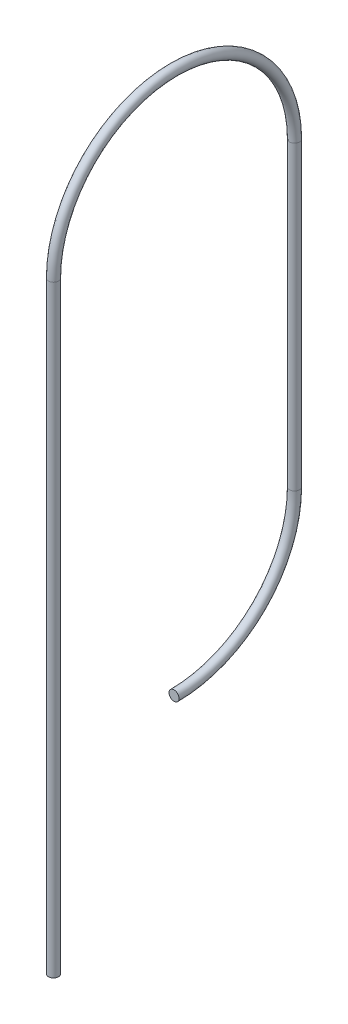
ISO-10303-21;
HEADER;
FILE_DESCRIPTION(('STEP AP214'),'2;1');
FILE_NAME('part.step','',(''),(''),'','','');
FILE_SCHEMA(('AUTOMOTIVE_DESIGN { 1 0 10303 214 1 1 1 1 }'));
ENDSEC;
DATA;
#1=APPLICATION_CONTEXT('core data for automotive mechanical design processes');
#2=APPLICATION_PROTOCOL_DEFINITION('international standard','automotive_design',2000,#1);
#3=PRODUCT_CONTEXT('',#1,'mechanical');
#4=PRODUCT('Part','Part','',(#3));
#5=PRODUCT_RELATED_PRODUCT_CATEGORY('part','',(#4));
#6=PRODUCT_DEFINITION_FORMATION('','',#4);
#7=PRODUCT_DEFINITION_CONTEXT('part definition',#1,'design');
#8=PRODUCT_DEFINITION('design','',#6,#7);
#9=PRODUCT_DEFINITION_SHAPE('','',#8);
#10=(LENGTH_UNIT() NAMED_UNIT(*) SI_UNIT(.MILLI.,.METRE.));
#11=(NAMED_UNIT(*) PLANE_ANGLE_UNIT() SI_UNIT($,.RADIAN.));
#12=(NAMED_UNIT(*) SI_UNIT($,.STERADIAN.) SOLID_ANGLE_UNIT());
#13=UNCERTAINTY_MEASURE_WITH_UNIT(LENGTH_MEASURE(1.E-05),#10,'distance_accuracy_value','');
#14=(GEOMETRIC_REPRESENTATION_CONTEXT(3) GLOBAL_UNCERTAINTY_ASSIGNED_CONTEXT((#13)) GLOBAL_UNIT_ASSIGNED_CONTEXT((#10,
#11,#12)) REPRESENTATION_CONTEXT('',''));
#15=CARTESIAN_POINT('',(0.,0.,0.));
#16=DIRECTION('',(0.,0.,1.));
#17=DIRECTION('',(1.,0.,0.));
#18=AXIS2_PLACEMENT_3D('',#15,#16,#17);
#19=CARTESIAN_POINT('',(0.,0.,0.));
#20=DIRECTION('',(0.,1.,0.));
#21=DIRECTION('',(0.,0.,1.));
#22=AXIS2_PLACEMENT_3D('',#19,#20,#21);
#23=PLANE('',#22);
#24=CARTESIAN_POINT('',(0.,0.,0.));
#25=DIRECTION('',(0.,1.,0.));
#26=DIRECTION('',(0.,0.,1.));
#27=AXIS2_PLACEMENT_3D('',#24,#25,#26);
#28=CIRCLE('',#27,1.25);
#29=CARTESIAN_POINT('',(0.,0.,1.25));
#30=VERTEX_POINT('',#29);
#31=EDGE_CURVE('E53',#30,#30,#28,.T.);
#32=ORIENTED_EDGE('',*,*,#31,.F.);
#33=EDGE_LOOP('',(#32));
#34=FACE_BOUND('',#33,.T.);
#35=ADVANCED_FACE('F34',(#34),#23,.F.);
#36=CARTESIAN_POINT('',(0.,45.0000006982674,-30.0064727151885));
#37=DIRECTION('',(0.,-0.000215757172950433,0.999999976724421));
#38=DIRECTION('',(0.,-0.999999976724421,-0.000215757172950433));
#39=AXIS2_PLACEMENT_3D('',#36,#37,#38);
#40=PLANE('',#39);
#41=CARTESIAN_POINT('',(0.,45.0000006982674,-30.0064727151885));
#42=DIRECTION('',(0.,-0.000215757172950433,0.999999976724421));
#43=DIRECTION('',(0.,-0.999999976724421,-0.000215757172950433));
#44=AXIS2_PLACEMENT_3D('',#41,#42,#43);
#45=CIRCLE('',#44,1.25);
#46=CARTESIAN_POINT('',(0.,43.7500007273619,-30.0067424116547));
#47=VERTEX_POINT('',#46);
#48=EDGE_CURVE('E10',#47,#47,#45,.T.);
#49=ORIENTED_EDGE('',*,*,#48,.T.);
#50=EDGE_LOOP('',(#49));
#51=FACE_BOUND('',#50,.T.);
#52=ADVANCED_FACE('F60',(#51),#40,.T.);
#53=CARTESIAN_POINT('',(0.,0.,0.));
#54=DIRECTION('',(0.,1.,0.));
#55=DIRECTION('',(0.,0.,1.));
#56=AXIS2_PLACEMENT_3D('',#53,#54,#55);
#57=CYLINDRICAL_SURFACE('',#56,1.25);
#58=CARTESIAN_POINT('',(0.,150.,0.));
#59=DIRECTION('',(0.,1.,0.));
#60=DIRECTION('',(0.,0.,1.));
#61=AXIS2_PLACEMENT_3D('',#58,#59,#60);
#62=CIRCLE('',#61,1.25);
#63=CARTESIAN_POINT('',(0.,150.,1.25));
#64=VERTEX_POINT('',#63);
#65=EDGE_CURVE('E48',#64,#64,#62,.T.);
#66=ORIENTED_EDGE('',*,*,#65,.F.);
#67=EDGE_LOOP('',(#66));
#68=FACE_BOUND('',#67,.T.);
#69=ORIENTED_EDGE('',*,*,#31,.T.);
#70=EDGE_LOOP('',(#69));
#71=FACE_BOUND('',#70,.T.);
#72=ADVANCED_FACE('F57',(#68,#71),#57,.T.);
#73=CARTESIAN_POINT('',(0.,150.,-30.));
#74=DIRECTION('',(-1.,0.,0.));
#75=DIRECTION('',(0.,0.,1.));
#76=AXIS2_PLACEMENT_3D('',#73,#74,#75);
#77=TOROIDAL_SURFACE('',#76,30.,1.25);
#78=CARTESIAN_POINT('',(0.,150.,-60.));
#79=DIRECTION('',(0.,-1.,0.));
#80=DIRECTION('',(0.,0.,-1.));
#81=AXIS2_PLACEMENT_3D('',#78,#79,#80);
#82=CIRCLE('',#81,1.25);
#83=CARTESIAN_POINT('',(0.,150.,-61.25));
#84=VERTEX_POINT('',#83);
#85=EDGE_CURVE('E44',#84,#84,#82,.T.);
#86=CARTESIAN_POINT('',(0.,150.,-30.));
#87=DIRECTION('',(-1.,0.,0.));
#88=DIRECTION('',(0.,0.,1.));
#89=AXIS2_PLACEMENT_3D('',#86,#87,#88);
#90=CIRCLE('',#89,31.25);
#91=EDGE_CURVE('',#64,#84,#90,.T.);
#92=ORIENTED_EDGE('',*,*,#65,.T.);
#93=ORIENTED_EDGE('',*,*,#85,.F.);
#94=ORIENTED_EDGE('',*,*,#91,.T.);
#95=ORIENTED_EDGE('',*,*,#91,.F.);
#96=EDGE_LOOP('',(#92,#94,#93,#95));
#97=FACE_BOUND('',#96,.T.);
#98=ADVANCED_FACE('F72',(#97),#77,.T.);
#99=CARTESIAN_POINT('',(0.,150.,-60.));
#100=DIRECTION('',(0.,-1.,0.));
#101=DIRECTION('',(0.,0.,-1.));
#102=AXIS2_PLACEMENT_3D('',#99,#100,#101);
#103=CYLINDRICAL_SURFACE('',#102,1.25);
#104=CARTESIAN_POINT('',(0.,75.,-60.));
#105=DIRECTION('',(0.,-1.,0.));
#106=DIRECTION('',(0.,0.,-1.));
#107=AXIS2_PLACEMENT_3D('',#104,#105,#106);
#108=CIRCLE('',#107,1.25);
#109=CARTESIAN_POINT('',(0.,75.,-61.25));
#110=VERTEX_POINT('',#109);
#111=EDGE_CURVE('E40',#110,#110,#108,.T.);
#112=ORIENTED_EDGE('',*,*,#111,.F.);
#113=EDGE_LOOP('',(#112));
#114=FACE_BOUND('',#113,.T.);
#115=ORIENTED_EDGE('',*,*,#85,.T.);
#116=EDGE_LOOP('',(#115));
#117=FACE_BOUND('',#116,.T.);
#118=ADVANCED_FACE('F66',(#114,#117),#103,.T.);
#119=CARTESIAN_POINT('',(0.,75.,-30.));
#120=DIRECTION('',(-1.,0.,0.));
#121=DIRECTION('',(0.,0.,1.));
#122=AXIS2_PLACEMENT_3D('',#119,#120,#121);
#123=TOROIDAL_SURFACE('',#122,30.,1.25);
#124=CARTESIAN_POINT('',(0.,75.,-30.));
#125=DIRECTION('',(-1.,0.,0.));
#126=DIRECTION('',(0.,0.,1.));
#127=AXIS2_PLACEMENT_3D('',#124,#125,#126);
#128=CIRCLE('',#127,31.25);
#129=EDGE_CURVE('',#110,#47,#128,.T.);
#130=ORIENTED_EDGE('',*,*,#111,.T.);
#131=ORIENTED_EDGE('',*,*,#48,.F.);
#132=ORIENTED_EDGE('',*,*,#129,.T.);
#133=ORIENTED_EDGE('',*,*,#129,.F.);
#134=EDGE_LOOP('',(#130,#132,#131,#133));
#135=FACE_BOUND('',#134,.T.);
#136=ADVANCED_FACE('F64',(#135),#123,.T.);
#137=CLOSED_SHELL('',(#35,#52,#72,#98,#118,#136));
#138=MANIFOLD_SOLID_BREP('B2',#137);
#139=ADVANCED_BREP_SHAPE_REPRESENTATION('',(#18,#138),#14);
#140=SHAPE_DEFINITION_REPRESENTATION(#9,#139);
ENDSEC;
END-ISO-10303-21;
